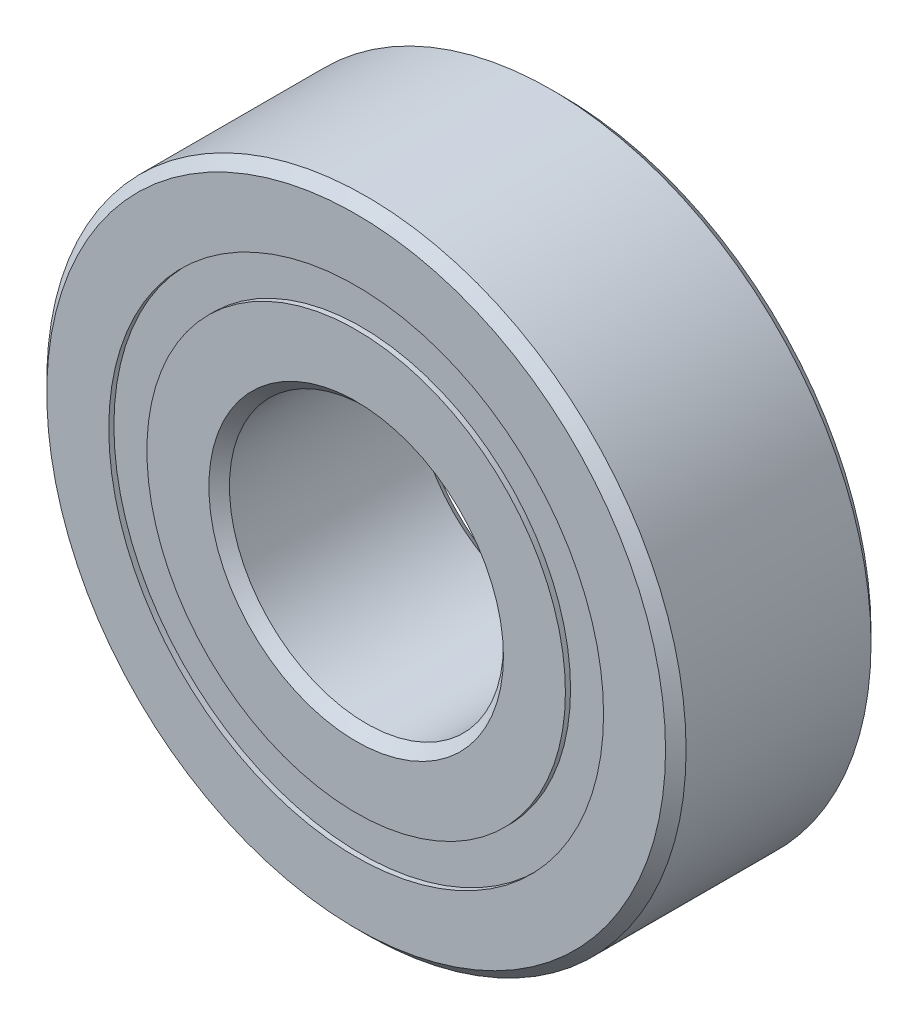
ISO-10303-21;
HEADER;
FILE_DESCRIPTION(('STEP AP214'),'2;1');
FILE_NAME('part.step','',(''),(''),'','','');
FILE_SCHEMA(('AUTOMOTIVE_DESIGN { 1 0 10303 214 1 1 1 1 }'));
ENDSEC;
DATA;
#1=APPLICATION_CONTEXT('core data for automotive mechanical design processes');
#2=APPLICATION_PROTOCOL_DEFINITION('international standard','automotive_design',2000,#1);
#3=PRODUCT_CONTEXT('',#1,'mechanical');
#4=PRODUCT('Part','Part','',(#3));
#5=PRODUCT_RELATED_PRODUCT_CATEGORY('part','',(#4));
#6=PRODUCT_DEFINITION_FORMATION('','',#4);
#7=PRODUCT_DEFINITION_CONTEXT('part definition',#1,'design');
#8=PRODUCT_DEFINITION('design','',#6,#7);
#9=PRODUCT_DEFINITION_SHAPE('','',#8);
#10=(LENGTH_UNIT() NAMED_UNIT(*) SI_UNIT(.MILLI.,.METRE.));
#11=(NAMED_UNIT(*) PLANE_ANGLE_UNIT() SI_UNIT($,.RADIAN.));
#12=(NAMED_UNIT(*) SI_UNIT($,.STERADIAN.) SOLID_ANGLE_UNIT());
#13=UNCERTAINTY_MEASURE_WITH_UNIT(LENGTH_MEASURE(1.E-05),#10,'distance_accuracy_value','');
#14=(GEOMETRIC_REPRESENTATION_CONTEXT(3) GLOBAL_UNCERTAINTY_ASSIGNED_CONTEXT((#13)) GLOBAL_UNIT_ASSIGNED_CONTEXT((#10,
#11,#12)) REPRESENTATION_CONTEXT('',''));
#15=CARTESIAN_POINT('',(0.,0.,0.));
#16=DIRECTION('',(0.,0.,1.));
#17=DIRECTION('',(1.,0.,0.));
#18=AXIS2_PLACEMENT_3D('',#15,#16,#17);
#19=CARTESIAN_POINT('',(0.,8.60041208791209,-3.39328125));
#20=DIRECTION('',(0.,0.,1.));
#21=DIRECTION('',(1.,0.,0.));
#22=AXIS2_PLACEMENT_3D('',#19,#20,#21);
#23=PLANE('',#22);
#24=CARTESIAN_POINT('',(0.,0.,-3.39328125));
#25=DIRECTION('',(0.,0.,1.));
#26=DIRECTION('',(1.,0.,0.));
#27=AXIS2_PLACEMENT_3D('',#24,#25,#26);
#28=CIRCLE('',#27,8.60041208791209);
#29=CARTESIAN_POINT('',(8.60041208791209,0.,-3.39328125));
#30=VERTEX_POINT('',#29);
#31=EDGE_CURVE('E61',#30,#30,#28,.T.);
#32=ORIENTED_EDGE('',*,*,#31,.F.);
#33=EDGE_LOOP('',(#32));
#34=FACE_BOUND('',#33,.T.);
#35=CARTESIAN_POINT('',(0.,0.,-3.39328125));
#36=DIRECTION('',(0.,0.,1.));
#37=DIRECTION('',(1.,0.,0.));
#38=AXIS2_PLACEMENT_3D('',#35,#36,#37);
#39=CIRCLE('',#38,7.27458791208791);
#40=CARTESIAN_POINT('',(7.27458791208791,0.,-3.39328125));
#41=VERTEX_POINT('',#40);
#42=EDGE_CURVE('E11',#41,#41,#39,.T.);
#43=ORIENTED_EDGE('',*,*,#42,.T.);
#44=EDGE_LOOP('',(#43));
#45=FACE_BOUND('',#44,.T.);
#46=ADVANCED_FACE('F47',(#34,#45),#23,.F.);
#47=CARTESIAN_POINT('',(0.,0.,3.571875));
#48=DIRECTION('',(0.,0.,1.));
#49=DIRECTION('',(1.,0.,0.));
#50=AXIS2_PLACEMENT_3D('',#47,#48,#49);
#51=CYLINDRICAL_SURFACE('',#50,7.27458791208791);
#52=ORIENTED_EDGE('',*,*,#42,.F.);
#53=EDGE_LOOP('',(#52));
#54=FACE_BOUND('',#53,.T.);
#55=CARTESIAN_POINT('',(0.,0.,-1.72035132641561));
#56=DIRECTION('',(0.,0.,1.));
#57=DIRECTION('',(1.,0.,0.));
#58=AXIS2_PLACEMENT_3D('',#55,#56,#57);
#59=CIRCLE('',#58,7.27458791208791);
#60=CARTESIAN_POINT('',(7.27458791208791,0.,-1.72035132641561));
#61=VERTEX_POINT('',#60);
#62=EDGE_CURVE('E53',#61,#61,#59,.T.);
#63=ORIENTED_EDGE('',*,*,#62,.T.);
#64=EDGE_LOOP('',(#63));
#65=FACE_BOUND('',#64,.T.);
#66=ADVANCED_FACE('F70',(#54,#65),#51,.F.);
#67=CARTESIAN_POINT('',(0.,8.60041208791209,-1.72035132641561));
#68=DIRECTION('',(0.,0.,-1.));
#69=DIRECTION('',(-1.,0.,0.));
#70=AXIS2_PLACEMENT_3D('',#67,#68,#69);
#71=PLANE('',#70);
#72=ORIENTED_EDGE('',*,*,#62,.F.);
#73=EDGE_LOOP('',(#72));
#74=FACE_BOUND('',#73,.T.);
#75=CARTESIAN_POINT('',(0.,0.,-1.72035132641561));
#76=DIRECTION('',(0.,0.,1.));
#77=DIRECTION('',(1.,0.,0.));
#78=AXIS2_PLACEMENT_3D('',#75,#76,#77);
#79=CIRCLE('',#78,8.60041208791209);
#80=CARTESIAN_POINT('',(8.60041208791209,0.,-1.72035132641561));
#81=VERTEX_POINT('',#80);
#82=EDGE_CURVE('E57',#81,#81,#79,.T.);
#83=ORIENTED_EDGE('',*,*,#82,.T.);
#84=EDGE_LOOP('',(#83));
#85=FACE_BOUND('',#84,.T.);
#86=ADVANCED_FACE('F74',(#74,#85),#71,.F.);
#87=CARTESIAN_POINT('',(0.,0.,3.571875));
#88=DIRECTION('',(0.,0.,1.));
#89=DIRECTION('',(1.,0.,0.));
#90=AXIS2_PLACEMENT_3D('',#87,#88,#89);
#91=CYLINDRICAL_SURFACE('',#90,8.60041208791209);
#92=ORIENTED_EDGE('',*,*,#82,.F.);
#93=EDGE_LOOP('',(#92));
#94=FACE_BOUND('',#93,.T.);
#95=ORIENTED_EDGE('',*,*,#31,.T.);
#96=EDGE_LOOP('',(#95));
#97=FACE_BOUND('',#96,.T.);
#98=ADVANCED_FACE('F67',(#94,#97),#91,.T.);
#99=CLOSED_SHELL('',(#46,#66,#86,#98));
#100=MANIFOLD_SOLID_BREP('B2',#99);
#101=CARTESIAN_POINT('',(0.,8.60041208791209,3.39328125));
#102=DIRECTION('',(0.,0.,-1.));
#103=DIRECTION('',(-1.,0.,0.));
#104=AXIS2_PLACEMENT_3D('',#101,#102,#103);
#105=PLANE('',#104);
#106=CARTESIAN_POINT('',(0.,0.,3.39328125));
#107=DIRECTION('',(0.,0.,1.));
#108=DIRECTION('',(1.,0.,0.));
#109=AXIS2_PLACEMENT_3D('',#106,#107,#108);
#110=CIRCLE('',#109,7.27458791208791);
#111=CARTESIAN_POINT('',(7.27458791208791,0.,3.39328125));
#112=VERTEX_POINT('',#111);
#113=EDGE_CURVE('E46',#112,#112,#110,.T.);
#114=ORIENTED_EDGE('',*,*,#113,.F.);
#115=EDGE_LOOP('',(#114));
#116=FACE_BOUND('',#115,.T.);
#117=CARTESIAN_POINT('',(0.,0.,3.39328125));
#118=DIRECTION('',(0.,0.,1.));
#119=DIRECTION('',(1.,0.,0.));
#120=AXIS2_PLACEMENT_3D('',#117,#118,#119);
#121=CIRCLE('',#120,8.60041208791209);
#122=CARTESIAN_POINT('',(8.60041208791209,0.,3.39328125));
#123=VERTEX_POINT('',#122);
#124=EDGE_CURVE('E128',#123,#123,#121,.T.);
#125=ORIENTED_EDGE('',*,*,#124,.T.);
#126=EDGE_LOOP('',(#125));
#127=FACE_BOUND('',#126,.T.);
#128=ADVANCED_FACE('F114',(#116,#127),#105,.F.);
#129=CARTESIAN_POINT('',(0.,0.,3.571875));
#130=DIRECTION('',(0.,0.,1.));
#131=DIRECTION('',(1.,0.,0.));
#132=AXIS2_PLACEMENT_3D('',#129,#130,#131);
#133=CYLINDRICAL_SURFACE('',#132,7.27458791208791);
#134=CARTESIAN_POINT('',(0.,0.,1.72035132641561));
#135=DIRECTION('',(0.,0.,1.));
#136=DIRECTION('',(1.,0.,0.));
#137=AXIS2_PLACEMENT_3D('',#134,#135,#136);
#138=CIRCLE('',#137,7.27458791208791);
#139=CARTESIAN_POINT('',(7.27458791208791,0.,1.72035132641561));
#140=VERTEX_POINT('',#139);
#141=EDGE_CURVE('E120',#140,#140,#138,.T.);
#142=ORIENTED_EDGE('',*,*,#141,.F.);
#143=EDGE_LOOP('',(#142));
#144=FACE_BOUND('',#143,.T.);
#145=ORIENTED_EDGE('',*,*,#113,.T.);
#146=EDGE_LOOP('',(#145));
#147=FACE_BOUND('',#146,.T.);
#148=ADVANCED_FACE('F143',(#144,#147),#133,.F.);
#149=CARTESIAN_POINT('',(0.,8.60041208791209,1.72035132641562));
#150=DIRECTION('',(0.,0.,1.));
#151=DIRECTION('',(1.,0.,0.));
#152=AXIS2_PLACEMENT_3D('',#149,#150,#151);
#153=PLANE('',#152);
#154=CARTESIAN_POINT('',(0.,0.,1.72035132641562));
#155=DIRECTION('',(0.,0.,1.));
#156=DIRECTION('',(1.,0.,0.));
#157=AXIS2_PLACEMENT_3D('',#154,#155,#156);
#158=CIRCLE('',#157,8.60041208791209);
#159=CARTESIAN_POINT('',(8.60041208791209,0.,1.72035132641562));
#160=VERTEX_POINT('',#159);
#161=EDGE_CURVE('E124',#160,#160,#158,.T.);
#162=ORIENTED_EDGE('',*,*,#161,.F.);
#163=EDGE_LOOP('',(#162));
#164=FACE_BOUND('',#163,.T.);
#165=ORIENTED_EDGE('',*,*,#141,.T.);
#166=EDGE_LOOP('',(#165));
#167=FACE_BOUND('',#166,.T.);
#168=ADVANCED_FACE('F138',(#164,#167),#153,.F.);
#169=CARTESIAN_POINT('',(0.,0.,3.571875));
#170=DIRECTION('',(0.,0.,1.));
#171=DIRECTION('',(1.,0.,0.));
#172=AXIS2_PLACEMENT_3D('',#169,#170,#171);
#173=CYLINDRICAL_SURFACE('',#172,8.60041208791209);
#174=ORIENTED_EDGE('',*,*,#124,.F.);
#175=EDGE_LOOP('',(#174));
#176=FACE_BOUND('',#175,.T.);
#177=ORIENTED_EDGE('',*,*,#161,.T.);
#178=EDGE_LOOP('',(#177));
#179=FACE_BOUND('',#178,.T.);
#180=ADVANCED_FACE('F135',(#176,#179),#173,.T.);
#181=CLOSED_SHELL('',(#128,#148,#168,#180));
#182=MANIFOLD_SOLID_BREP('B6',#181);
#183=CARTESIAN_POINT('',(-4.66554544007142,6.42157239285121,0.));
#184=DIRECTION('',(0.,0.,1.));
#185=DIRECTION('',(-0.587785252292462,0.809016994374955,0.));
#186=AXIS2_PLACEMENT_3D('',#183,#184,#185);
#187=SPHERICAL_SURFACE('',#186,1.72035132641561);
#188=CARTESIAN_POINT('',(-4.66554544007142,6.42157239285121,1.72035132641562));
#189=VERTEX_POINT('',#188);
#190=VERTEX_LOOP('',#189);
#191=FACE_BOUND('',#190,.T.);
#192=ADVANCED_FACE('F181',(#191),#187,.T.);
#193=CLOSED_SHELL('',(#192));
#194=MANIFOLD_SOLID_BREP('B41',#193);
#195=CARTESIAN_POINT('',(-7.54901109809275,2.45282239285123,0.));
#196=DIRECTION('',(0.,0.,1.));
#197=DIRECTION('',(-0.95105651629515,0.309016994374958,0.));
#198=AXIS2_PLACEMENT_3D('',#195,#196,#197);
#199=SPHERICAL_SURFACE('',#198,1.72035132641561);
#200=CARTESIAN_POINT('',(-7.54901109809275,2.45282239285123,1.72035132641562));
#201=VERTEX_POINT('',#200);
#202=VERTEX_LOOP('',#201);
#203=FACE_BOUND('',#202,.T.);
#204=ADVANCED_FACE('F202',(#203),#199,.T.);
#205=CLOSED_SHELL('',(#204));
#206=MANIFOLD_SOLID_BREP('B110',#205);
#207=CARTESIAN_POINT('',(-7.54901109809281,-2.45282239285107,0.));
#208=DIRECTION('',(0.,0.,1.));
#209=DIRECTION('',(-0.951056516295157,-0.309016994374938,0.));
#210=AXIS2_PLACEMENT_3D('',#207,#208,#209);
#211=SPHERICAL_SURFACE('',#210,1.72035132641561);
#212=CARTESIAN_POINT('',(-7.54901109809281,-2.45282239285107,1.72035132641562));
#213=VERTEX_POINT('',#212);
#214=VERTEX_LOOP('',#213);
#215=FACE_BOUND('',#214,.T.);
#216=ADVANCED_FACE('F225',(#215),#211,.T.);
#217=CLOSED_SHELL('',(#216));
#218=MANIFOLD_SOLID_BREP('B177',#217);
#219=CARTESIAN_POINT('',(-4.66554544007156,-6.4215723928511,0.));
#220=DIRECTION('',(0.,0.,1.));
#221=DIRECTION('',(-0.58778525229248,-0.809016994374942,0.));
#222=AXIS2_PLACEMENT_3D('',#219,#220,#221);
#223=SPHERICAL_SURFACE('',#222,1.72035132641561);
#224=CARTESIAN_POINT('',(-4.66554544007156,-6.4215723928511,1.72035132641562));
#225=VERTEX_POINT('',#224);
#226=VERTEX_LOOP('',#225);
#227=FACE_BOUND('',#226,.T.);
#228=ADVANCED_FACE('F245',(#227),#223,.T.);
#229=CLOSED_SHELL('',(#228));
#230=MANIFOLD_SOLID_BREP('B198',#229);
#231=CARTESIAN_POINT('',(0.,-7.9375,0.));
#232=DIRECTION('',(0.,0.,1.));
#233=DIRECTION('',(0.,-1.,0.));
#234=AXIS2_PLACEMENT_3D('',#231,#232,#233);
#235=SPHERICAL_SURFACE('',#234,1.72035132641561);
#236=CARTESIAN_POINT('',(0.,-7.9375,1.72035132641562));
#237=VERTEX_POINT('',#236);
#238=VERTEX_LOOP('',#237);
#239=FACE_BOUND('',#238,.T.);
#240=ADVANCED_FACE('F265',(#239),#235,.T.);
#241=CLOSED_SHELL('',(#240));
#242=MANIFOLD_SOLID_BREP('B221',#241);
#243=CARTESIAN_POINT('',(4.66554544007147,-6.42157239285117,0.));
#244=DIRECTION('',(0.,0.,1.));
#245=DIRECTION('',(0.587785252292469,-0.809016994374951,0.));
#246=AXIS2_PLACEMENT_3D('',#243,#244,#245);
#247=SPHERICAL_SURFACE('',#246,1.72035132641561);
#248=CARTESIAN_POINT('',(4.66554544007147,-6.42157239285117,1.72035132641562));
#249=VERTEX_POINT('',#248);
#250=VERTEX_LOOP('',#249);
#251=FACE_BOUND('',#250,.T.);
#252=ADVANCED_FACE('F285',(#251),#247,.T.);
#253=CLOSED_SHELL('',(#252));
#254=MANIFOLD_SOLID_BREP('B241',#253);
#255=CARTESIAN_POINT('',(7.54901109809277,-2.45282239285118,0.));
#256=DIRECTION('',(0.,0.,1.));
#257=DIRECTION('',(0.951056516295152,-0.309016994374952,0.));
#258=AXIS2_PLACEMENT_3D('',#255,#256,#257);
#259=SPHERICAL_SURFACE('',#258,1.72035132641561);
#260=CARTESIAN_POINT('',(7.54901109809277,-2.45282239285118,1.72035132641562));
#261=VERTEX_POINT('',#260);
#262=VERTEX_LOOP('',#261);
#263=FACE_BOUND('',#262,.T.);
#264=ADVANCED_FACE('F306',(#263),#259,.T.);
#265=CLOSED_SHELL('',(#264));
#266=MANIFOLD_SOLID_BREP('B261',#265);
#267=CARTESIAN_POINT('',(7.54901109809279,2.45282239285112,0.));
#268=DIRECTION('',(0.,0.,1.));
#269=DIRECTION('',(0.951056516295155,0.309016994374945,0.));
#270=AXIS2_PLACEMENT_3D('',#267,#268,#269);
#271=SPHERICAL_SURFACE('',#270,1.72035132641561);
#272=CARTESIAN_POINT('',(7.54901109809279,2.45282239285112,1.72035132641562));
#273=VERTEX_POINT('',#272);
#274=VERTEX_LOOP('',#273);
#275=FACE_BOUND('',#274,.T.);
#276=ADVANCED_FACE('F329',(#275),#271,.T.);
#277=CLOSED_SHELL('',(#276));
#278=MANIFOLD_SOLID_BREP('B281',#277);
#279=CARTESIAN_POINT('',(4.66554544007152,6.42157239285114,0.));
#280=DIRECTION('',(0.,0.,1.));
#281=DIRECTION('',(0.587785252292474,0.809016994374947,0.));
#282=AXIS2_PLACEMENT_3D('',#279,#280,#281);
#283=SPHERICAL_SURFACE('',#282,1.72035132641561);
#284=CARTESIAN_POINT('',(4.66554544007152,6.42157239285114,1.72035132641562));
#285=VERTEX_POINT('',#284);
#286=VERTEX_LOOP('',#285);
#287=FACE_BOUND('',#286,.T.);
#288=ADVANCED_FACE('F349',(#287),#283,.T.);
#289=CLOSED_SHELL('',(#288));
#290=MANIFOLD_SOLID_BREP('B302',#289);
#291=CARTESIAN_POINT('',(0.,7.9375,0.));
#292=DIRECTION('',(0.,0.,1.));
#293=DIRECTION('',(0.,1.,0.));
#294=AXIS2_PLACEMENT_3D('',#291,#292,#293);
#295=SPHERICAL_SURFACE('',#294,1.72035132641561);
#296=CARTESIAN_POINT('',(0.,7.9375,1.72035132641562));
#297=VERTEX_POINT('',#296);
#298=VERTEX_LOOP('',#297);
#299=FACE_BOUND('',#298,.T.);
#300=ADVANCED_FACE('F372',(#299),#295,.T.);
#301=CLOSED_SHELL('',(#300));
#302=MANIFOLD_SOLID_BREP('B325',#301);
#303=CARTESIAN_POINT('',(0.,7.27458791208791,3.571875));
#304=DIRECTION('',(0.,0.,-1.));
#305=DIRECTION('',(-1.,0.,0.));
#306=AXIS2_PLACEMENT_3D('',#303,#304,#305);
#307=PLANE('',#306);
#308=CARTESIAN_POINT('',(0.,0.,3.571875));
#309=DIRECTION('',(0.,0.,1.));
#310=DIRECTION('',(1.,0.,0.));
#311=AXIS2_PLACEMENT_3D('',#308,#309,#310);
#312=CIRCLE('',#311,5.1196875);
#313=CARTESIAN_POINT('',(5.1196875,0.,3.571875));
#314=VERTEX_POINT('',#313);
#315=EDGE_CURVE('E424',#314,#314,#312,.T.);
#316=ORIENTED_EDGE('',*,*,#315,.F.);
#317=EDGE_LOOP('',(#316));
#318=FACE_BOUND('',#317,.T.);
#319=CARTESIAN_POINT('',(0.,0.,3.571875));
#320=DIRECTION('',(0.,0.,1.));
#321=DIRECTION('',(1.,0.,0.));
#322=AXIS2_PLACEMENT_3D('',#319,#320,#321);
#323=CIRCLE('',#322,7.27458791208791);
#324=CARTESIAN_POINT('',(7.27458791208791,0.,3.571875));
#325=VERTEX_POINT('',#324);
#326=EDGE_CURVE('E371',#325,#325,#323,.T.);
#327=ORIENTED_EDGE('',*,*,#326,.T.);
#328=EDGE_LOOP('',(#327));
#329=FACE_BOUND('',#328,.T.);
#330=ADVANCED_FACE('F396',(#318,#329),#307,.F.);
#331=CARTESIAN_POINT('',(0.,0.,3.571875));
#332=DIRECTION('',(0.,0.,1.));
#333=DIRECTION('',(1.,0.,0.));
#334=AXIS2_PLACEMENT_3D('',#331,#332,#333);
#335=CYLINDRICAL_SURFACE('',#334,7.27458791208791);
#336=ORIENTED_EDGE('',*,*,#326,.F.);
#337=EDGE_LOOP('',(#336));
#338=FACE_BOUND('',#337,.T.);
#339=CARTESIAN_POINT('',(0.,0.,1.5875));
#340=DIRECTION('',(0.,0.,1.));
#341=DIRECTION('',(1.,0.,0.));
#342=AXIS2_PLACEMENT_3D('',#339,#340,#341);
#343=CIRCLE('',#342,7.27458791208791);
#344=CARTESIAN_POINT('',(7.27458791208791,0.,1.5875));
#345=VERTEX_POINT('',#344);
#346=EDGE_CURVE('E402',#345,#345,#343,.T.);
#347=ORIENTED_EDGE('',*,*,#346,.T.);
#348=EDGE_LOOP('',(#347));
#349=FACE_BOUND('',#348,.T.);
#350=ADVANCED_FACE('F431',(#338,#349),#335,.T.);
#351=CARTESIAN_POINT('',(0.,0.,0.));
#352=DIRECTION('',(0.,0.,1.));
#353=DIRECTION('',(1.,0.,0.));
#354=AXIS2_PLACEMENT_3D('',#351,#352,#353);
#355=TOROIDAL_SURFACE('',#354,7.93749999999999,1.72035132641561);
#356=ORIENTED_EDGE('',*,*,#346,.F.);
#357=EDGE_LOOP('',(#356));
#358=FACE_BOUND('',#357,.T.);
#359=CARTESIAN_POINT('',(0.,0.,-1.5875));
#360=DIRECTION('',(0.,0.,1.));
#361=DIRECTION('',(1.,0.,0.));
#362=AXIS2_PLACEMENT_3D('',#359,#360,#361);
#363=CIRCLE('',#362,7.27458791208791);
#364=CARTESIAN_POINT('',(7.27458791208791,0.,-1.5875));
#365=VERTEX_POINT('',#364);
#366=EDGE_CURVE('E406',#365,#365,#363,.T.);
#367=ORIENTED_EDGE('',*,*,#366,.T.);
#368=EDGE_LOOP('',(#367));
#369=FACE_BOUND('',#368,.T.);
#370=ADVANCED_FACE('F435',(#358,#369),#355,.F.);
#371=CARTESIAN_POINT('',(0.,0.,3.571875));
#372=DIRECTION('',(0.,0.,1.));
#373=DIRECTION('',(1.,0.,0.));
#374=AXIS2_PLACEMENT_3D('',#371,#372,#373);
#375=CYLINDRICAL_SURFACE('',#374,7.27458791208791);
#376=ORIENTED_EDGE('',*,*,#366,.F.);
#377=EDGE_LOOP('',(#376));
#378=FACE_BOUND('',#377,.T.);
#379=CARTESIAN_POINT('',(0.,0.,-3.571875));
#380=DIRECTION('',(0.,0.,1.));
#381=DIRECTION('',(1.,0.,0.));
#382=AXIS2_PLACEMENT_3D('',#379,#380,#381);
#383=CIRCLE('',#382,7.27458791208791);
#384=CARTESIAN_POINT('',(7.27458791208791,0.,-3.571875));
#385=VERTEX_POINT('',#384);
#386=EDGE_CURVE('E410',#385,#385,#383,.T.);
#387=ORIENTED_EDGE('',*,*,#386,.T.);
#388=EDGE_LOOP('',(#387));
#389=FACE_BOUND('',#388,.T.);
#390=ADVANCED_FACE('F440',(#378,#389),#375,.T.);
#391=CARTESIAN_POINT('',(0.,5.1196875,-3.571875));
#392=DIRECTION('',(0.,0.,1.));
#393=DIRECTION('',(1.,0.,0.));
#394=AXIS2_PLACEMENT_3D('',#391,#392,#393);
#395=PLANE('',#394);
#396=ORIENTED_EDGE('',*,*,#386,.F.);
#397=EDGE_LOOP('',(#396));
#398=FACE_BOUND('',#397,.T.);
#399=CARTESIAN_POINT('',(0.,0.,-3.571875));
#400=DIRECTION('',(0.,0.,1.));
#401=DIRECTION('',(1.,0.,0.));
#402=AXIS2_PLACEMENT_3D('',#399,#400,#401);
#403=CIRCLE('',#402,5.1196875);
#404=CARTESIAN_POINT('',(5.1196875,0.,-3.571875));
#405=VERTEX_POINT('',#404);
#406=EDGE_CURVE('E415',#405,#405,#403,.T.);
#407=ORIENTED_EDGE('',*,*,#406,.T.);
#408=EDGE_LOOP('',(#407));
#409=FACE_BOUND('',#408,.T.);
#410=ADVANCED_FACE('F446',(#398,#409),#395,.F.);
#411=CARTESIAN_POINT('',(0.,0.,-3.2146875));
#412=DIRECTION('',(0.,0.,-1.));
#413=DIRECTION('',(-1.,0.,0.));
#414=AXIS2_PLACEMENT_3D('',#411,#412,#413);
#415=CONICAL_SURFACE('',#414,4.7625,0.785398163397444);
#416=ORIENTED_EDGE('',*,*,#406,.F.);
#417=EDGE_LOOP('',(#416));
#418=FACE_BOUND('',#417,.T.);
#419=CARTESIAN_POINT('',(0.,0.,-3.2146875));
#420=DIRECTION('',(0.,0.,1.));
#421=DIRECTION('',(1.,0.,0.));
#422=AXIS2_PLACEMENT_3D('',#419,#420,#421);
#423=CIRCLE('',#422,4.7625);
#424=CARTESIAN_POINT('',(4.7625,0.,-3.2146875));
#425=VERTEX_POINT('',#424);
#426=EDGE_CURVE('E418',#425,#425,#423,.T.);
#427=ORIENTED_EDGE('',*,*,#426,.T.);
#428=EDGE_LOOP('',(#427));
#429=FACE_BOUND('',#428,.T.);
#430=ADVANCED_FACE('F450',(#418,#429),#415,.F.);
#431=CARTESIAN_POINT('',(0.,0.,3.571875));
#432=DIRECTION('',(0.,0.,1.));
#433=DIRECTION('',(1.,0.,0.));
#434=AXIS2_PLACEMENT_3D('',#431,#432,#433);
#435=CYLINDRICAL_SURFACE('',#434,4.7625);
#436=ORIENTED_EDGE('',*,*,#426,.F.);
#437=EDGE_LOOP('',(#436));
#438=FACE_BOUND('',#437,.T.);
#439=CARTESIAN_POINT('',(0.,0.,3.2146875));
#440=DIRECTION('',(0.,0.,1.));
#441=DIRECTION('',(1.,0.,0.));
#442=AXIS2_PLACEMENT_3D('',#439,#440,#441);
#443=CIRCLE('',#442,4.7625);
#444=CARTESIAN_POINT('',(4.7625,0.,3.2146875));
#445=VERTEX_POINT('',#444);
#446=EDGE_CURVE('E421',#445,#445,#443,.T.);
#447=ORIENTED_EDGE('',*,*,#446,.T.);
#448=EDGE_LOOP('',(#447));
#449=FACE_BOUND('',#448,.T.);
#450=ADVANCED_FACE('F454',(#438,#449),#435,.F.);
#451=CARTESIAN_POINT('',(0.,0.,3.571875));
#452=DIRECTION('',(0.,0.,1.));
#453=DIRECTION('',(1.,0.,0.));
#454=AXIS2_PLACEMENT_3D('',#451,#452,#453);
#455=CONICAL_SURFACE('',#454,5.1196875,0.785398163397453);
#456=ORIENTED_EDGE('',*,*,#446,.F.);
#457=EDGE_LOOP('',(#456));
#458=FACE_BOUND('',#457,.T.);
#459=ORIENTED_EDGE('',*,*,#315,.T.);
#460=EDGE_LOOP('',(#459));
#461=FACE_BOUND('',#460,.T.);
#462=ADVANCED_FACE('F428',(#458,#461),#455,.F.);
#463=CLOSED_SHELL('',(#330,#350,#370,#390,#410,#430,#450,#462));
#464=MANIFOLD_SOLID_BREP('B345',#463);
#465=CARTESIAN_POINT('',(0.,0.,3.2146875));
#466=DIRECTION('',(0.,0.,-1.));
#467=DIRECTION('',(-1.,0.,0.));
#468=AXIS2_PLACEMENT_3D('',#465,#466,#467);
#469=CONICAL_SURFACE('',#468,11.1125,0.785398163397446);
#470=CARTESIAN_POINT('',(0.,0.,3.571875));
#471=DIRECTION('',(0.,0.,1.));
#472=DIRECTION('',(1.,0.,0.));
#473=AXIS2_PLACEMENT_3D('',#470,#471,#472);
#474=CIRCLE('',#473,10.7553125);
#475=CARTESIAN_POINT('',(10.7553125,0.,3.571875));
#476=VERTEX_POINT('',#475);
#477=EDGE_CURVE('E551',#476,#476,#474,.T.);
#478=ORIENTED_EDGE('',*,*,#477,.F.);
#479=EDGE_LOOP('',(#478));
#480=FACE_BOUND('',#479,.T.);
#481=CARTESIAN_POINT('',(0.,0.,3.2146875));
#482=DIRECTION('',(0.,0.,1.));
#483=DIRECTION('',(1.,0.,0.));
#484=AXIS2_PLACEMENT_3D('',#481,#482,#483);
#485=CIRCLE('',#484,11.1125);
#486=CARTESIAN_POINT('',(11.1125,0.,3.2146875));
#487=VERTEX_POINT('',#486);
#488=EDGE_CURVE('E395',#487,#487,#485,.T.);
#489=ORIENTED_EDGE('',*,*,#488,.T.);
#490=EDGE_LOOP('',(#489));
#491=FACE_BOUND('',#490,.T.);
#492=ADVANCED_FACE('F523',(#480,#491),#469,.T.);
#493=CARTESIAN_POINT('',(0.,0.,3.571875));
#494=DIRECTION('',(0.,0.,1.));
#495=DIRECTION('',(1.,0.,0.));
#496=AXIS2_PLACEMENT_3D('',#493,#494,#495);
#497=CYLINDRICAL_SURFACE('',#496,11.1125);
#498=ORIENTED_EDGE('',*,*,#488,.F.);
#499=EDGE_LOOP('',(#498));
#500=FACE_BOUND('',#499,.T.);
#501=CARTESIAN_POINT('',(0.,0.,-3.2146875));
#502=DIRECTION('',(0.,0.,1.));
#503=DIRECTION('',(1.,0.,0.));
#504=AXIS2_PLACEMENT_3D('',#501,#502,#503);
#505=CIRCLE('',#504,11.1125);
#506=CARTESIAN_POINT('',(11.1125,0.,-3.2146875));
#507=VERTEX_POINT('',#506);
#508=EDGE_CURVE('E529',#507,#507,#505,.T.);
#509=ORIENTED_EDGE('',*,*,#508,.T.);
#510=EDGE_LOOP('',(#509));
#511=FACE_BOUND('',#510,.T.);
#512=ADVANCED_FACE('F558',(#500,#511),#497,.T.);
#513=CARTESIAN_POINT('',(0.,0.,-3.571875));
#514=DIRECTION('',(0.,0.,1.));
#515=DIRECTION('',(1.,0.,0.));
#516=AXIS2_PLACEMENT_3D('',#513,#514,#515);
#517=CONICAL_SURFACE('',#516,10.7553125,0.785398163397444);
#518=ORIENTED_EDGE('',*,*,#508,.F.);
#519=EDGE_LOOP('',(#518));
#520=FACE_BOUND('',#519,.T.);
#521=CARTESIAN_POINT('',(0.,0.,-3.571875));
#522=DIRECTION('',(0.,0.,1.));
#523=DIRECTION('',(1.,0.,0.));
#524=AXIS2_PLACEMENT_3D('',#521,#522,#523);
#525=CIRCLE('',#524,10.7553125);
#526=CARTESIAN_POINT('',(10.7553125,0.,-3.571875));
#527=VERTEX_POINT('',#526);
#528=EDGE_CURVE('E533',#527,#527,#525,.T.);
#529=ORIENTED_EDGE('',*,*,#528,.T.);
#530=EDGE_LOOP('',(#529));
#531=FACE_BOUND('',#530,.T.);
#532=ADVANCED_FACE('F562',(#520,#531),#517,.T.);
#533=CARTESIAN_POINT('',(0.,10.7553125,-3.571875));
#534=DIRECTION('',(0.,0.,1.));
#535=DIRECTION('',(1.,0.,0.));
#536=AXIS2_PLACEMENT_3D('',#533,#534,#535);
#537=PLANE('',#536);
#538=ORIENTED_EDGE('',*,*,#528,.F.);
#539=EDGE_LOOP('',(#538));
#540=FACE_BOUND('',#539,.T.);
#541=CARTESIAN_POINT('',(0.,0.,-3.571875));
#542=DIRECTION('',(0.,0.,1.));
#543=DIRECTION('',(1.,0.,0.));
#544=AXIS2_PLACEMENT_3D('',#541,#542,#543);
#545=CIRCLE('',#544,8.60041208791209);
#546=CARTESIAN_POINT('',(8.60041208791209,0.,-3.571875));
#547=VERTEX_POINT('',#546);
#548=EDGE_CURVE('E537',#547,#547,#545,.T.);
#549=ORIENTED_EDGE('',*,*,#548,.T.);
#550=EDGE_LOOP('',(#549));
#551=FACE_BOUND('',#550,.T.);
#552=ADVANCED_FACE('F567',(#540,#551),#537,.F.);
#553=CARTESIAN_POINT('',(0.,0.,3.571875));
#554=DIRECTION('',(0.,0.,1.));
#555=DIRECTION('',(1.,0.,0.));
#556=AXIS2_PLACEMENT_3D('',#553,#554,#555);
#557=CYLINDRICAL_SURFACE('',#556,8.60041208791209);
#558=ORIENTED_EDGE('',*,*,#548,.F.);
#559=EDGE_LOOP('',(#558));
#560=FACE_BOUND('',#559,.T.);
#561=CARTESIAN_POINT('',(0.,0.,-1.5875));
#562=DIRECTION('',(0.,0.,1.));
#563=DIRECTION('',(1.,0.,0.));
#564=AXIS2_PLACEMENT_3D('',#561,#562,#563);
#565=CIRCLE('',#564,8.60041208791209);
#566=CARTESIAN_POINT('',(8.60041208791209,0.,-1.5875));
#567=VERTEX_POINT('',#566);
#568=EDGE_CURVE('E542',#567,#567,#565,.T.);
#569=ORIENTED_EDGE('',*,*,#568,.T.);
#570=EDGE_LOOP('',(#569));
#571=FACE_BOUND('',#570,.T.);
#572=ADVANCED_FACE('F573',(#560,#571),#557,.F.);
#573=CARTESIAN_POINT('',(0.,0.,0.));
#574=DIRECTION('',(0.,0.,1.));
#575=DIRECTION('',(1.,0.,0.));
#576=AXIS2_PLACEMENT_3D('',#573,#574,#575);
#577=TOROIDAL_SURFACE('',#576,7.9375,1.72035132641561);
#578=ORIENTED_EDGE('',*,*,#568,.F.);
#579=EDGE_LOOP('',(#578));
#580=FACE_BOUND('',#579,.T.);
#581=CARTESIAN_POINT('',(0.,0.,1.5875));
#582=DIRECTION('',(0.,0.,1.));
#583=DIRECTION('',(1.,0.,0.));
#584=AXIS2_PLACEMENT_3D('',#581,#582,#583);
#585=CIRCLE('',#584,8.60041208791209);
#586=CARTESIAN_POINT('',(8.60041208791209,0.,1.5875));
#587=VERTEX_POINT('',#586);
#588=EDGE_CURVE('E545',#587,#587,#585,.T.);
#589=ORIENTED_EDGE('',*,*,#588,.T.);
#590=EDGE_LOOP('',(#589));
#591=FACE_BOUND('',#590,.T.);
#592=ADVANCED_FACE('F577',(#580,#591),#577,.F.);
#593=CARTESIAN_POINT('',(0.,0.,3.571875));
#594=DIRECTION('',(0.,0.,1.));
#595=DIRECTION('',(1.,0.,0.));
#596=AXIS2_PLACEMENT_3D('',#593,#594,#595);
#597=CYLINDRICAL_SURFACE('',#596,8.60041208791209);
#598=ORIENTED_EDGE('',*,*,#588,.F.);
#599=EDGE_LOOP('',(#598));
#600=FACE_BOUND('',#599,.T.);
#601=CARTESIAN_POINT('',(0.,0.,3.571875));
#602=DIRECTION('',(0.,0.,1.));
#603=DIRECTION('',(1.,0.,0.));
#604=AXIS2_PLACEMENT_3D('',#601,#602,#603);
#605=CIRCLE('',#604,8.60041208791209);
#606=CARTESIAN_POINT('',(8.60041208791209,0.,3.571875));
#607=VERTEX_POINT('',#606);
#608=EDGE_CURVE('E548',#607,#607,#605,.T.);
#609=ORIENTED_EDGE('',*,*,#608,.T.);
#610=EDGE_LOOP('',(#609));
#611=FACE_BOUND('',#610,.T.);
#612=ADVANCED_FACE('F581',(#600,#611),#597,.F.);
#613=CARTESIAN_POINT('',(0.,10.7553125,3.571875));
#614=DIRECTION('',(0.,0.,-1.));
#615=DIRECTION('',(-1.,0.,0.));
#616=AXIS2_PLACEMENT_3D('',#613,#614,#615);
#617=PLANE('',#616);
#618=ORIENTED_EDGE('',*,*,#608,.F.);
#619=EDGE_LOOP('',(#618));
#620=FACE_BOUND('',#619,.T.);
#621=ORIENTED_EDGE('',*,*,#477,.T.);
#622=EDGE_LOOP('',(#621));
#623=FACE_BOUND('',#622,.T.);
#624=ADVANCED_FACE('F555',(#620,#623),#617,.F.);
#625=CLOSED_SHELL('',(#492,#512,#532,#552,#572,#592,#612,#624));
#626=MANIFOLD_SOLID_BREP('B366',#625);
#627=ADVANCED_BREP_SHAPE_REPRESENTATION('',(#18,#100,#182,#194,#206,#218,#230,#242,#254,#266,
#278,#290,#302,#464,#626),#14);
#628=SHAPE_DEFINITION_REPRESENTATION(#9,#627);
ENDSEC;
END-ISO-10303-21;
